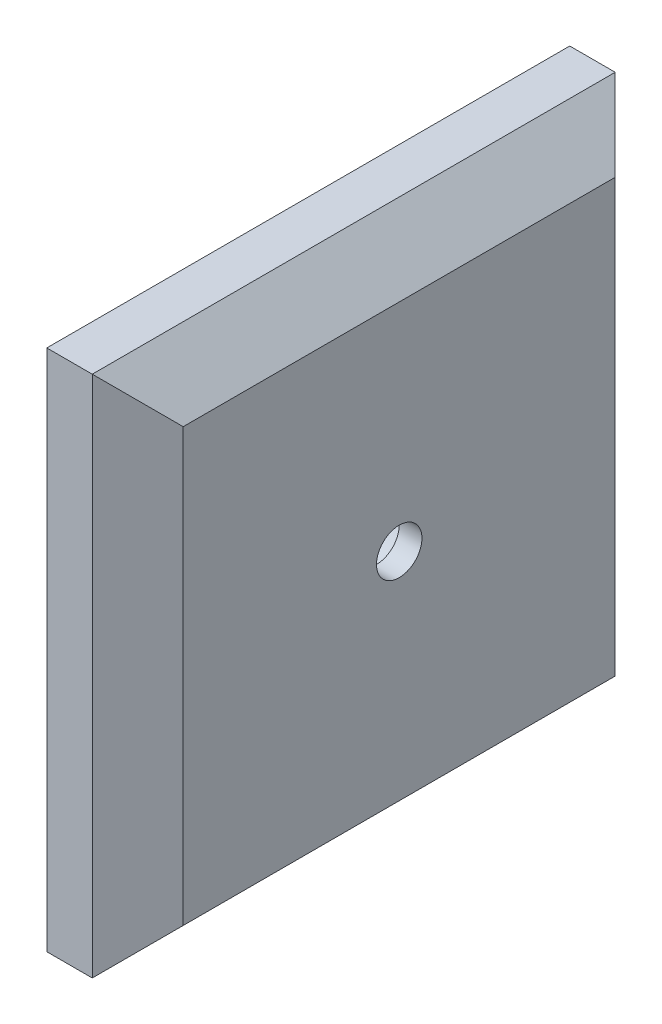
ISO-10303-21;
HEADER;
FILE_DESCRIPTION(('STEP AP214'),'2;1');
FILE_NAME('part.step','',(''),(''),'','','');
FILE_SCHEMA(('AUTOMOTIVE_DESIGN { 1 0 10303 214 1 1 1 1 }'));
ENDSEC;
DATA;
#1=APPLICATION_CONTEXT('core data for automotive mechanical design processes');
#2=APPLICATION_PROTOCOL_DEFINITION('international standard','automotive_design',2000,#1);
#3=PRODUCT_CONTEXT('',#1,'mechanical');
#4=PRODUCT('Part','Part','',(#3));
#5=PRODUCT_RELATED_PRODUCT_CATEGORY('part','',(#4));
#6=PRODUCT_DEFINITION_FORMATION('','',#4);
#7=PRODUCT_DEFINITION_CONTEXT('part definition',#1,'design');
#8=PRODUCT_DEFINITION('design','',#6,#7);
#9=PRODUCT_DEFINITION_SHAPE('','',#8);
#10=(LENGTH_UNIT() NAMED_UNIT(*) SI_UNIT(.MILLI.,.METRE.));
#11=(NAMED_UNIT(*) PLANE_ANGLE_UNIT() SI_UNIT($,.RADIAN.));
#12=(NAMED_UNIT(*) SI_UNIT($,.STERADIAN.) SOLID_ANGLE_UNIT());
#13=UNCERTAINTY_MEASURE_WITH_UNIT(LENGTH_MEASURE(1.E-05),#10,'distance_accuracy_value','');
#14=(GEOMETRIC_REPRESENTATION_CONTEXT(3) GLOBAL_UNCERTAINTY_ASSIGNED_CONTEXT((#13)) GLOBAL_UNIT_ASSIGNED_CONTEXT((#10,
#11,#12)) REPRESENTATION_CONTEXT('',''));
#15=CARTESIAN_POINT('',(0.,0.,0.));
#16=DIRECTION('',(0.,0.,1.));
#17=DIRECTION('',(1.,0.,0.));
#18=AXIS2_PLACEMENT_3D('',#15,#16,#17);
#19=CARTESIAN_POINT('',(12.7,36.5125,-36.5125));
#20=DIRECTION('',(0.,0.,1.));
#21=DIRECTION('',(1.,0.,0.));
#22=AXIS2_PLACEMENT_3D('',#19,#20,#21);
#23=PLANE('',#22);
#24=DIRECTION('',(-1.,0.,0.));
#25=VECTOR('',#24,1.);
#26=CARTESIAN_POINT('',(12.7,36.5125,-36.5125));
#27=LINE('',#26,#25);
#28=CARTESIAN_POINT('',(6.34999999999996,36.5125,-36.5125));
#29=VERTEX_POINT('',#28);
#30=CARTESIAN_POINT('',(0.,36.5125,-36.5125));
#31=VERTEX_POINT('',#30);
#32=EDGE_CURVE('E100',#29,#31,#27,.T.);
#33=ORIENTED_EDGE('',*,*,#32,.F.);
#34=DIRECTION('',(0.,-1.,0.));
#35=VECTOR('',#34,1.);
#36=CARTESIAN_POINT('',(6.34999999999996,-36.5125,-36.5125));
#37=LINE('',#36,#35);
#38=CARTESIAN_POINT('',(6.34999999999996,-36.5125,-36.5125));
#39=VERTEX_POINT('',#38);
#40=EDGE_CURVE('E158',#29,#39,#37,.T.);
#41=ORIENTED_EDGE('',*,*,#40,.T.);
#42=DIRECTION('',(-1.,0.,0.));
#43=VECTOR('',#42,1.);
#44=CARTESIAN_POINT('',(12.7,-36.5125,-36.5125));
#45=LINE('',#44,#43);
#46=CARTESIAN_POINT('',(0.,-36.5125,-36.5125));
#47=VERTEX_POINT('',#46);
#48=EDGE_CURVE('E123',#39,#47,#45,.T.);
#49=ORIENTED_EDGE('',*,*,#48,.T.);
#50=DIRECTION('',(0.,1.,0.));
#51=VECTOR('',#50,1.);
#52=CARTESIAN_POINT('',(0.,36.5125,-36.5125));
#53=LINE('',#52,#51);
#54=EDGE_CURVE('E118',#47,#31,#53,.T.);
#55=ORIENTED_EDGE('',*,*,#54,.T.);
#56=EDGE_LOOP('',(#33,#41,#49,#55));
#57=FACE_BOUND('',#56,.T.);
#58=ADVANCED_FACE('F44',(#57),#23,.F.);
#59=CARTESIAN_POINT('',(12.7,36.5125,36.5125));
#60=DIRECTION('',(0.,-1.,0.));
#61=DIRECTION('',(0.,0.,-1.));
#62=AXIS2_PLACEMENT_3D('',#59,#60,#61);
#63=PLANE('',#62);
#64=DIRECTION('',(-1.,0.,0.));
#65=VECTOR('',#64,1.);
#66=CARTESIAN_POINT('',(12.7,36.5125,36.5125));
#67=LINE('',#66,#65);
#68=CARTESIAN_POINT('',(6.34999999999996,36.5125,36.5125));
#69=VERTEX_POINT('',#68);
#70=CARTESIAN_POINT('',(0.,36.5125,36.5125));
#71=VERTEX_POINT('',#70);
#72=EDGE_CURVE('E112',#69,#71,#67,.T.);
#73=ORIENTED_EDGE('',*,*,#72,.F.);
#74=DIRECTION('',(0.,0.,-1.));
#75=VECTOR('',#74,1.);
#76=CARTESIAN_POINT('',(6.34999999999996,36.5125,-36.5125));
#77=LINE('',#76,#75);
#78=EDGE_CURVE('E11',#69,#29,#77,.T.);
#79=ORIENTED_EDGE('',*,*,#78,.T.);
#80=ORIENTED_EDGE('',*,*,#32,.T.);
#81=DIRECTION('',(0.,0.,1.));
#82=VECTOR('',#81,1.);
#83=CARTESIAN_POINT('',(0.,36.5125,36.5125));
#84=LINE('',#83,#82);
#85=EDGE_CURVE('E103',#31,#71,#84,.T.);
#86=ORIENTED_EDGE('',*,*,#85,.T.);
#87=EDGE_LOOP('',(#73,#79,#80,#86));
#88=FACE_BOUND('',#87,.T.);
#89=ADVANCED_FACE('F102',(#88),#63,.F.);
#90=CARTESIAN_POINT('',(12.7,36.5125,36.5125));
#91=DIRECTION('',(0.,0.,-1.));
#92=DIRECTION('',(-1.,0.,0.));
#93=AXIS2_PLACEMENT_3D('',#90,#91,#92);
#94=PLANE('',#93);
#95=DIRECTION('',(-1.,0.,0.));
#96=VECTOR('',#95,1.);
#97=CARTESIAN_POINT('',(12.7,-36.5125,36.5125));
#98=LINE('',#97,#96);
#99=CARTESIAN_POINT('',(6.34999999999996,-36.5125,36.5125));
#100=VERTEX_POINT('',#99);
#101=CARTESIAN_POINT('',(0.,-36.5125,36.5125));
#102=VERTEX_POINT('',#101);
#103=EDGE_CURVE('E141',#100,#102,#98,.T.);
#104=ORIENTED_EDGE('',*,*,#103,.F.);
#105=DIRECTION('',(0.,1.,0.));
#106=VECTOR('',#105,1.);
#107=CARTESIAN_POINT('',(6.34999999999996,36.5125,36.5125));
#108=LINE('',#107,#106);
#109=EDGE_CURVE('E55',#100,#69,#108,.T.);
#110=ORIENTED_EDGE('',*,*,#109,.T.);
#111=ORIENTED_EDGE('',*,*,#72,.T.);
#112=DIRECTION('',(0.,-1.,0.));
#113=VECTOR('',#112,1.);
#114=CARTESIAN_POINT('',(0.,36.5125,36.5125));
#115=LINE('',#114,#113);
#116=EDGE_CURVE('E120',#71,#102,#115,.T.);
#117=ORIENTED_EDGE('',*,*,#116,.T.);
#118=EDGE_LOOP('',(#104,#110,#111,#117));
#119=FACE_BOUND('',#118,.T.);
#120=ADVANCED_FACE('F188',(#119),#94,.F.);
#121=CARTESIAN_POINT('',(12.7,-36.5125,36.5125));
#122=DIRECTION('',(0.,1.,0.));
#123=DIRECTION('',(0.,0.,1.));
#124=AXIS2_PLACEMENT_3D('',#121,#122,#123);
#125=PLANE('',#124);
#126=ORIENTED_EDGE('',*,*,#48,.F.);
#127=DIRECTION('',(0.,0.,1.));
#128=VECTOR('',#127,1.);
#129=CARTESIAN_POINT('',(6.34999999999996,-36.5125,36.5125));
#130=LINE('',#129,#128);
#131=EDGE_CURVE('E70',#39,#100,#130,.T.);
#132=ORIENTED_EDGE('',*,*,#131,.T.);
#133=ORIENTED_EDGE('',*,*,#103,.T.);
#134=DIRECTION('',(0.,0.,-1.));
#135=VECTOR('',#134,1.);
#136=CARTESIAN_POINT('',(0.,-36.5125,36.5125));
#137=LINE('',#136,#135);
#138=EDGE_CURVE('E136',#102,#47,#137,.T.);
#139=ORIENTED_EDGE('',*,*,#138,.T.);
#140=EDGE_LOOP('',(#126,#132,#133,#139));
#141=FACE_BOUND('',#140,.T.);
#142=ADVANCED_FACE('F187',(#141),#125,.F.);
#143=CARTESIAN_POINT('',(12.7,0.,0.));
#144=DIRECTION('',(1.,0.,0.));
#145=DIRECTION('',(0.,0.,-1.));
#146=AXIS2_PLACEMENT_3D('',#143,#144,#145);
#147=PLANE('',#146);
#148=CARTESIAN_POINT('',(12.7,0.,0.));
#149=DIRECTION('',(1.,0.,0.));
#150=DIRECTION('',(0.,0.,-1.));
#151=AXIS2_PLACEMENT_3D('',#148,#149,#150);
#152=CIRCLE('',#151,3.175);
#153=CARTESIAN_POINT('',(12.7,0.,-3.175));
#154=VERTEX_POINT('',#153);
#155=EDGE_CURVE('E131',#154,#154,#152,.T.);
#156=ORIENTED_EDGE('',*,*,#155,.F.);
#157=EDGE_LOOP('',(#156));
#158=FACE_BOUND('',#157,.T.);
#159=DIRECTION('',(0.,0.,-1.));
#160=VECTOR('',#159,1.);
#161=CARTESIAN_POINT('',(12.7,-30.1625,-36.5125));
#162=LINE('',#161,#160);
#163=CARTESIAN_POINT('',(12.7,-30.1625,30.1625));
#164=VERTEX_POINT('',#163);
#165=CARTESIAN_POINT('',(12.7,-30.1625,-30.1625));
#166=VERTEX_POINT('',#165);
#167=EDGE_CURVE('E151',#164,#166,#162,.T.);
#168=ORIENTED_EDGE('',*,*,#167,.T.);
#169=DIRECTION('',(0.,1.,0.));
#170=VECTOR('',#169,1.);
#171=CARTESIAN_POINT('',(12.7,36.5125,-30.1625));
#172=LINE('',#171,#170);
#173=CARTESIAN_POINT('',(12.7,30.1625,-30.1625));
#174=VERTEX_POINT('',#173);
#175=EDGE_CURVE('E154',#166,#174,#172,.T.);
#176=ORIENTED_EDGE('',*,*,#175,.T.);
#177=DIRECTION('',(0.,0.,1.));
#178=VECTOR('',#177,1.);
#179=CARTESIAN_POINT('',(12.7,30.1625,36.5125));
#180=LINE('',#179,#178);
#181=CARTESIAN_POINT('',(12.7,30.1625,30.1625));
#182=VERTEX_POINT('',#181);
#183=EDGE_CURVE('E111',#174,#182,#180,.T.);
#184=ORIENTED_EDGE('',*,*,#183,.T.);
#185=DIRECTION('',(0.,-1.,0.));
#186=VECTOR('',#185,1.);
#187=CARTESIAN_POINT('',(12.7,-36.5125,30.1625));
#188=LINE('',#187,#186);
#189=EDGE_CURVE('E148',#182,#164,#188,.T.);
#190=ORIENTED_EDGE('',*,*,#189,.T.);
#191=EDGE_LOOP('',(#168,#176,#184,#190));
#192=FACE_BOUND('',#191,.T.);
#193=ADVANCED_FACE('F182',(#158,#192),#147,.T.);
#194=CARTESIAN_POINT('',(0.,0.,0.));
#195=DIRECTION('',(1.,0.,0.));
#196=DIRECTION('',(0.,0.,-1.));
#197=AXIS2_PLACEMENT_3D('',#194,#195,#196);
#198=PLANE('',#197);
#199=CARTESIAN_POINT('',(0.,0.,0.));
#200=DIRECTION('',(-1.,0.,0.));
#201=DIRECTION('',(0.,0.,1.));
#202=AXIS2_PLACEMENT_3D('',#199,#200,#201);
#203=CIRCLE('',#202,6.35);
#204=CARTESIAN_POINT('',(0.,0.,6.35));
#205=VERTEX_POINT('',#204);
#206=EDGE_CURVE('E256',#205,#205,#203,.T.);
#207=ORIENTED_EDGE('',*,*,#206,.F.);
#208=EDGE_LOOP('',(#207));
#209=FACE_BOUND('',#208,.T.);
#210=ORIENTED_EDGE('',*,*,#54,.F.);
#211=ORIENTED_EDGE('',*,*,#138,.F.);
#212=ORIENTED_EDGE('',*,*,#116,.F.);
#213=ORIENTED_EDGE('',*,*,#85,.F.);
#214=EDGE_LOOP('',(#210,#211,#212,#213));
#215=FACE_BOUND('',#214,.T.);
#216=ADVANCED_FACE('F116',(#209,#215),#198,.F.);
#217=CARTESIAN_POINT('',(12.7,0.,30.1625));
#218=DIRECTION('',(0.707106781186548,0.,0.707106781186548));
#219=DIRECTION('',(0.,1.,0.));
#220=AXIS2_PLACEMENT_3D('',#217,#218,#219);
#221=PLANE('',#220);
#222=DIRECTION('',(0.577350269189626,-0.577350269189626,-0.577350269189626));
#223=VECTOR('',#222,1.);
#224=CARTESIAN_POINT('',(22.7541666666667,20.1083333333333,20.1083333333333));
#225=LINE('',#224,#223);
#226=EDGE_CURVE('E129',#69,#182,#225,.T.);
#227=ORIENTED_EDGE('',*,*,#226,.F.);
#228=ORIENTED_EDGE('',*,*,#109,.F.);
#229=DIRECTION('',(0.577350269189626,0.577350269189626,-0.577350269189626));
#230=VECTOR('',#229,1.);
#231=CARTESIAN_POINT('',(22.7541666666667,-20.1083333333333,20.1083333333333));
#232=LINE('',#231,#230);
#233=EDGE_CURVE('E49',#164,#100,#232,.F.);
#234=ORIENTED_EDGE('',*,*,#233,.F.);
#235=ORIENTED_EDGE('',*,*,#189,.F.);
#236=EDGE_LOOP('',(#227,#228,#234,#235));
#237=FACE_BOUND('',#236,.T.);
#238=ADVANCED_FACE('F47',(#237),#221,.T.);
#239=CARTESIAN_POINT('',(12.7,-30.1625,0.));
#240=DIRECTION('',(0.707106781186548,-0.707106781186548,0.));
#241=DIRECTION('',(0.,0.,1.));
#242=AXIS2_PLACEMENT_3D('',#239,#240,#241);
#243=PLANE('',#242);
#244=ORIENTED_EDGE('',*,*,#233,.T.);
#245=ORIENTED_EDGE('',*,*,#131,.F.);
#246=DIRECTION('',(0.577350269189626,0.577350269189626,0.577350269189626));
#247=VECTOR('',#246,1.);
#248=CARTESIAN_POINT('',(22.7541666666667,-20.1083333333333,-20.1083333333333));
#249=LINE('',#248,#247);
#250=EDGE_CURVE('E168',#166,#39,#249,.F.);
#251=ORIENTED_EDGE('',*,*,#250,.F.);
#252=ORIENTED_EDGE('',*,*,#167,.F.);
#253=EDGE_LOOP('',(#244,#245,#251,#252));
#254=FACE_BOUND('',#253,.T.);
#255=ADVANCED_FACE('F213',(#254),#243,.T.);
#256=CARTESIAN_POINT('',(12.7,30.1625,0.));
#257=DIRECTION('',(0.707106781186548,0.707106781186548,0.));
#258=DIRECTION('',(0.,0.,-1.));
#259=AXIS2_PLACEMENT_3D('',#256,#257,#258);
#260=PLANE('',#259);
#261=ORIENTED_EDGE('',*,*,#226,.T.);
#262=ORIENTED_EDGE('',*,*,#183,.F.);
#263=DIRECTION('',(-0.577350269189626,0.577350269189626,-0.577350269189626));
#264=VECTOR('',#263,1.);
#265=CARTESIAN_POINT('',(22.7541666666667,20.1083333333333,-20.1083333333333));
#266=LINE('',#265,#264);
#267=EDGE_CURVE('E165',#29,#174,#266,.F.);
#268=ORIENTED_EDGE('',*,*,#267,.F.);
#269=ORIENTED_EDGE('',*,*,#78,.F.);
#270=EDGE_LOOP('',(#261,#262,#268,#269));
#271=FACE_BOUND('',#270,.T.);
#272=ADVANCED_FACE('F175',(#271),#260,.T.);
#273=CARTESIAN_POINT('',(12.7,0.,-30.1625));
#274=DIRECTION('',(0.707106781186548,0.,-0.707106781186548));
#275=DIRECTION('',(0.,-1.,0.));
#276=AXIS2_PLACEMENT_3D('',#273,#274,#275);
#277=PLANE('',#276);
#278=ORIENTED_EDGE('',*,*,#250,.T.);
#279=ORIENTED_EDGE('',*,*,#40,.F.);
#280=ORIENTED_EDGE('',*,*,#267,.T.);
#281=ORIENTED_EDGE('',*,*,#175,.F.);
#282=EDGE_LOOP('',(#278,#279,#280,#281));
#283=FACE_BOUND('',#282,.T.);
#284=ADVANCED_FACE('F186',(#283),#277,.T.);
#285=CARTESIAN_POINT('',(9.525,0.,0.));
#286=DIRECTION('',(1.,0.,0.));
#287=DIRECTION('',(0.,0.,-1.));
#288=AXIS2_PLACEMENT_3D('',#285,#286,#287);
#289=CYLINDRICAL_SURFACE('',#288,3.175);
#290=CARTESIAN_POINT('',(9.525,0.,0.));
#291=DIRECTION('',(1.,0.,0.));
#292=DIRECTION('',(0.,0.,-1.));
#293=AXIS2_PLACEMENT_3D('',#290,#291,#292);
#294=CIRCLE('',#293,3.175);
#295=CARTESIAN_POINT('',(9.525,0.,-3.175));
#296=VERTEX_POINT('',#295);
#297=EDGE_CURVE('E251',#296,#296,#294,.T.);
#298=ORIENTED_EDGE('',*,*,#297,.F.);
#299=EDGE_LOOP('',(#298));
#300=FACE_BOUND('',#299,.T.);
#301=ORIENTED_EDGE('',*,*,#155,.T.);
#302=EDGE_LOOP('',(#301));
#303=FACE_BOUND('',#302,.T.);
#304=ADVANCED_FACE('F208',(#300,#303),#289,.F.);
#305=CARTESIAN_POINT('',(9.525,0.,0.));
#306=DIRECTION('',(-1.,0.,0.));
#307=DIRECTION('',(0.,0.,1.));
#308=AXIS2_PLACEMENT_3D('',#305,#306,#307);
#309=PLANE('',#308);
#310=CARTESIAN_POINT('',(9.525,0.,0.));
#311=DIRECTION('',(-1.,0.,0.));
#312=DIRECTION('',(0.,0.,1.));
#313=AXIS2_PLACEMENT_3D('',#310,#311,#312);
#314=CIRCLE('',#313,6.35);
#315=CARTESIAN_POINT('',(9.525,0.,6.35));
#316=VERTEX_POINT('',#315);
#317=EDGE_CURVE('E248',#316,#316,#314,.T.);
#318=ORIENTED_EDGE('',*,*,#317,.T.);
#319=EDGE_LOOP('',(#318));
#320=FACE_BOUND('',#319,.T.);
#321=ORIENTED_EDGE('',*,*,#297,.T.);
#322=EDGE_LOOP('',(#321));
#323=FACE_BOUND('',#322,.T.);
#324=ADVANCED_FACE('F235',(#320,#323),#309,.T.);
#325=CARTESIAN_POINT('',(9.525,0.,0.));
#326=DIRECTION('',(-1.,0.,0.));
#327=DIRECTION('',(0.,0.,1.));
#328=AXIS2_PLACEMENT_3D('',#325,#326,#327);
#329=CYLINDRICAL_SURFACE('',#328,6.35);
#330=ORIENTED_EDGE('',*,*,#317,.F.);
#331=EDGE_LOOP('',(#330));
#332=FACE_BOUND('',#331,.T.);
#333=ORIENTED_EDGE('',*,*,#206,.T.);
#334=EDGE_LOOP('',(#333));
#335=FACE_BOUND('',#334,.T.);
#336=ADVANCED_FACE('F237',(#332,#335),#329,.F.);
#337=CLOSED_SHELL('',(#58,#89,#120,#142,#193,#216,#238,#255,#272,#284,#304,#324,#336));
#338=MANIFOLD_SOLID_BREP('B2',#337);
#339=ADVANCED_BREP_SHAPE_REPRESENTATION('',(#18,#338),#14);
#340=SHAPE_DEFINITION_REPRESENTATION(#9,#339);
ENDSEC;
END-ISO-10303-21;
